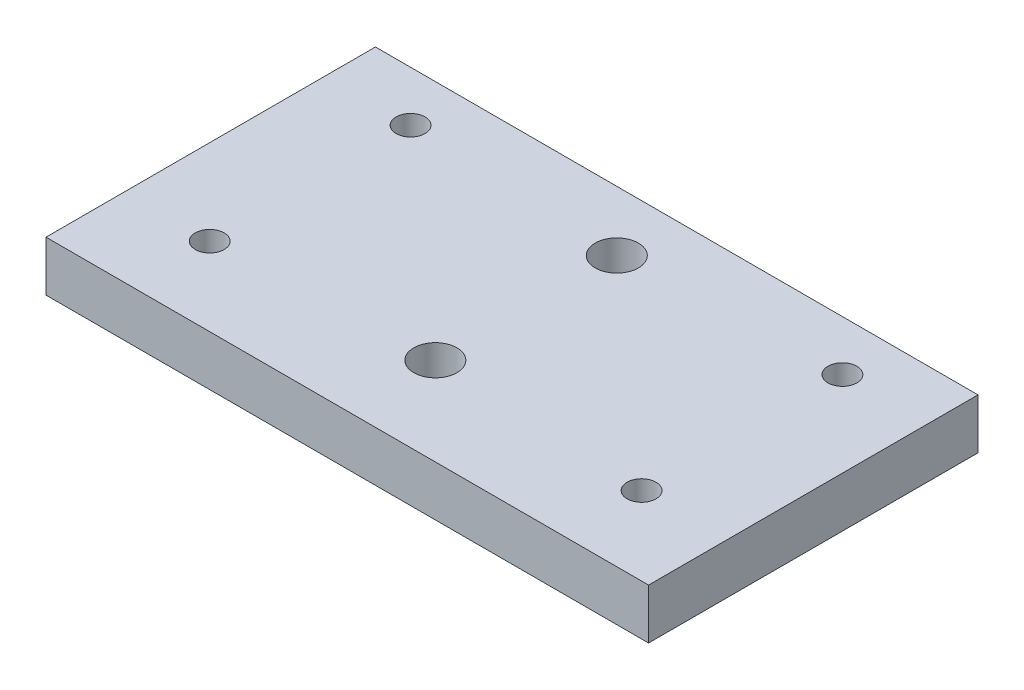
ISO-10303-21;
HEADER;
FILE_DESCRIPTION(('STEP AP214'),'2;1');
FILE_NAME('part.step','',(''),(''),'','','');
FILE_SCHEMA(('AUTOMOTIVE_DESIGN { 1 0 10303 214 1 1 1 1 }'));
ENDSEC;
DATA;
#1=APPLICATION_CONTEXT('core data for automotive mechanical design processes');
#2=APPLICATION_PROTOCOL_DEFINITION('international standard','automotive_design',2000,#1);
#3=PRODUCT_CONTEXT('',#1,'mechanical');
#4=PRODUCT('Part','Part','',(#3));
#5=PRODUCT_RELATED_PRODUCT_CATEGORY('part','',(#4));
#6=PRODUCT_DEFINITION_FORMATION('','',#4);
#7=PRODUCT_DEFINITION_CONTEXT('part definition',#1,'design');
#8=PRODUCT_DEFINITION('design','',#6,#7);
#9=PRODUCT_DEFINITION_SHAPE('','',#8);
#10=(LENGTH_UNIT() NAMED_UNIT(*) SI_UNIT(.MILLI.,.METRE.));
#11=(NAMED_UNIT(*) PLANE_ANGLE_UNIT() SI_UNIT($,.RADIAN.));
#12=(NAMED_UNIT(*) SI_UNIT($,.STERADIAN.) SOLID_ANGLE_UNIT());
#13=UNCERTAINTY_MEASURE_WITH_UNIT(LENGTH_MEASURE(1.E-05),#10,'distance_accuracy_value','');
#14=(GEOMETRIC_REPRESENTATION_CONTEXT(3) GLOBAL_UNCERTAINTY_ASSIGNED_CONTEXT((#13)) GLOBAL_UNIT_ASSIGNED_CONTEXT((#10,
#11,#12)) REPRESENTATION_CONTEXT('',''));
#15=CARTESIAN_POINT('',(0.,0.,0.));
#16=DIRECTION('',(0.,0.,1.));
#17=DIRECTION('',(1.,0.,0.));
#18=AXIS2_PLACEMENT_3D('',#15,#16,#17);
#19=CARTESIAN_POINT('',(38.1,-6.35,-76.2));
#20=DIRECTION('',(1.,0.,0.));
#21=DIRECTION('',(0.,0.,-1.));
#22=AXIS2_PLACEMENT_3D('',#19,#20,#21);
#23=PLANE('',#22);
#24=DIRECTION('',(0.,1.,0.));
#25=VECTOR('',#24,1.);
#26=CARTESIAN_POINT('',(38.1,-6.35,-34.5401915453713));
#27=LINE('',#26,#25);
#28=CARTESIAN_POINT('',(38.1,-6.35,-34.5401915453713));
#29=VERTEX_POINT('',#28);
#30=CARTESIAN_POINT('',(38.1,0.,-34.5401915453714));
#31=VERTEX_POINT('',#30);
#32=EDGE_CURVE('E47',#29,#31,#27,.T.);
#33=ORIENTED_EDGE('',*,*,#32,.F.);
#34=DIRECTION('',(0.,0.,-1.));
#35=VECTOR('',#34,1.);
#36=CARTESIAN_POINT('',(38.1,-6.35,-76.2));
#37=LINE('',#36,#35);
#38=CARTESIAN_POINT('',(38.1,-6.35,-76.2));
#39=VERTEX_POINT('',#38);
#40=EDGE_CURVE('E83',#29,#39,#37,.T.);
#41=ORIENTED_EDGE('',*,*,#40,.T.);
#42=DIRECTION('',(0.,1.,0.));
#43=VECTOR('',#42,1.);
#44=CARTESIAN_POINT('',(38.1,-6.35,-76.2));
#45=LINE('',#44,#43);
#46=CARTESIAN_POINT('',(38.1,0.,-76.2));
#47=VERTEX_POINT('',#46);
#48=EDGE_CURVE('E74',#39,#47,#45,.T.);
#49=ORIENTED_EDGE('',*,*,#48,.T.);
#50=DIRECTION('',(0.,0.,-1.));
#51=VECTOR('',#50,1.);
#52=CARTESIAN_POINT('',(38.1,0.,-76.2));
#53=LINE('',#52,#51);
#54=EDGE_CURVE('E88',#31,#47,#53,.T.);
#55=ORIENTED_EDGE('',*,*,#54,.F.);
#56=EDGE_LOOP('',(#33,#41,#49,#55));
#57=FACE_BOUND('',#56,.T.);
#58=ADVANCED_FACE('F34',(#57),#23,.T.);
#59=CARTESIAN_POINT('',(-38.1,-6.35,-76.2));
#60=DIRECTION('',(-1.,0.,0.));
#61=DIRECTION('',(0.,0.,1.));
#62=AXIS2_PLACEMENT_3D('',#59,#60,#61);
#63=PLANE('',#62);
#64=DIRECTION('',(0.,1.,0.));
#65=VECTOR('',#64,1.);
#66=CARTESIAN_POINT('',(-38.1,-6.35,-34.5401915453713));
#67=LINE('',#66,#65);
#68=CARTESIAN_POINT('',(-38.1,-6.35,-34.5401915453713));
#69=VERTEX_POINT('',#68);
#70=CARTESIAN_POINT('',(-38.1,0.,-34.5401915453713));
#71=VERTEX_POINT('',#70);
#72=EDGE_CURVE('E81',#69,#71,#67,.T.);
#73=ORIENTED_EDGE('',*,*,#72,.T.);
#74=DIRECTION('',(0.,0.,1.));
#75=VECTOR('',#74,1.);
#76=CARTESIAN_POINT('',(-38.1,0.,-76.2));
#77=LINE('',#76,#75);
#78=CARTESIAN_POINT('',(-38.1,0.,-76.2));
#79=VERTEX_POINT('',#78);
#80=EDGE_CURVE('E78',#79,#71,#77,.T.);
#81=ORIENTED_EDGE('',*,*,#80,.F.);
#82=DIRECTION('',(0.,1.,0.));
#83=VECTOR('',#82,1.);
#84=CARTESIAN_POINT('',(-38.1,-6.35,-76.2));
#85=LINE('',#84,#83);
#86=CARTESIAN_POINT('',(-38.1,-6.35,-76.2));
#87=VERTEX_POINT('',#86);
#88=EDGE_CURVE('E41',#87,#79,#85,.T.);
#89=ORIENTED_EDGE('',*,*,#88,.F.);
#90=DIRECTION('',(0.,0.,1.));
#91=VECTOR('',#90,1.);
#92=CARTESIAN_POINT('',(-38.1,-6.35,-76.2));
#93=LINE('',#92,#91);
#94=EDGE_CURVE('E94',#87,#69,#93,.T.);
#95=ORIENTED_EDGE('',*,*,#94,.T.);
#96=EDGE_LOOP('',(#73,#81,#89,#95));
#97=FACE_BOUND('',#96,.T.);
#98=ADVANCED_FACE('F79',(#97),#63,.T.);
#99=CARTESIAN_POINT('',(-38.1,-6.35,-76.2));
#100=DIRECTION('',(0.,0.,-1.));
#101=DIRECTION('',(-1.,0.,0.));
#102=AXIS2_PLACEMENT_3D('',#99,#100,#101);
#103=PLANE('',#102);
#104=DIRECTION('',(-1.,0.,0.));
#105=VECTOR('',#104,1.);
#106=CARTESIAN_POINT('',(-38.1,0.,-76.2));
#107=LINE('',#106,#105);
#108=EDGE_CURVE('E71',#47,#79,#107,.T.);
#109=ORIENTED_EDGE('',*,*,#108,.F.);
#110=ORIENTED_EDGE('',*,*,#48,.F.);
#111=DIRECTION('',(-1.,0.,0.));
#112=VECTOR('',#111,1.);
#113=CARTESIAN_POINT('',(-38.1,-6.35,-76.2));
#114=LINE('',#113,#112);
#115=EDGE_CURVE('E73',#39,#87,#114,.T.);
#116=ORIENTED_EDGE('',*,*,#115,.T.);
#117=ORIENTED_EDGE('',*,*,#88,.T.);
#118=EDGE_LOOP('',(#109,#110,#116,#117));
#119=FACE_BOUND('',#118,.T.);
#120=ADVANCED_FACE('F68',(#119),#103,.T.);
#121=CARTESIAN_POINT('',(0.,-6.35,0.));
#122=DIRECTION('',(0.,1.,0.));
#123=DIRECTION('',(0.,0.,1.));
#124=AXIS2_PLACEMENT_3D('',#121,#122,#123);
#125=PLANE('',#124);
#126=CARTESIAN_POINT('',(0.,-6.35,-68.6220095000234));
#127=DIRECTION('',(0.,1.,0.));
#128=DIRECTION('',(0.,0.,-1.));
#129=AXIS2_PLACEMENT_3D('',#126,#127,#128);
#130=CIRCLE('',#129,2.7305);
#131=CARTESIAN_POINT('',(0.,-6.35,-71.3525095000234));
#132=VERTEX_POINT('',#131);
#133=EDGE_CURVE('E127',#132,#132,#130,.T.);
#134=ORIENTED_EDGE('',*,*,#133,.T.);
#135=EDGE_LOOP('',(#134));
#136=FACE_BOUND('',#135,.T.);
#137=CARTESIAN_POINT('',(-27.305,-6.35,-69.85));
#138=DIRECTION('',(0.,1.,0.));
#139=DIRECTION('',(0.,0.,-1.));
#140=AXIS2_PLACEMENT_3D('',#137,#138,#139);
#141=CIRCLE('',#140,1.8288);
#142=CARTESIAN_POINT('',(-27.305,-6.35,-71.6788));
#143=VERTEX_POINT('',#142);
#144=EDGE_CURVE('E121',#143,#143,#141,.T.);
#145=ORIENTED_EDGE('',*,*,#144,.T.);
#146=EDGE_LOOP('',(#145));
#147=FACE_BOUND('',#146,.T.);
#148=CARTESIAN_POINT('',(27.305,-6.35,-69.85));
#149=DIRECTION('',(0.,1.,0.));
#150=DIRECTION('',(0.,0.,-1.));
#151=AXIS2_PLACEMENT_3D('',#148,#149,#150);
#152=CIRCLE('',#151,1.8288);
#153=CARTESIAN_POINT('',(27.305,-6.35,-71.6788));
#154=VERTEX_POINT('',#153);
#155=EDGE_CURVE('E115',#154,#154,#152,.T.);
#156=ORIENTED_EDGE('',*,*,#155,.T.);
#157=EDGE_LOOP('',(#156));
#158=FACE_BOUND('',#157,.T.);
#159=CARTESIAN_POINT('',(-27.305,-6.35,-44.45));
#160=DIRECTION('',(0.,1.,0.));
#161=DIRECTION('',(0.,0.,1.));
#162=AXIS2_PLACEMENT_3D('',#159,#160,#161);
#163=CIRCLE('',#162,1.8288);
#164=CARTESIAN_POINT('',(-27.305,-6.35,-42.6212));
#165=VERTEX_POINT('',#164);
#166=EDGE_CURVE('E109',#165,#165,#163,.T.);
#167=ORIENTED_EDGE('',*,*,#166,.T.);
#168=EDGE_LOOP('',(#167));
#169=FACE_BOUND('',#168,.T.);
#170=CARTESIAN_POINT('',(0.,-6.35,-45.6779904999767));
#171=DIRECTION('',(0.,1.,0.));
#172=DIRECTION('',(0.,0.,1.));
#173=AXIS2_PLACEMENT_3D('',#170,#171,#172);
#174=CIRCLE('',#173,2.7305);
#175=CARTESIAN_POINT('',(0.,-6.35,-42.9474904999767));
#176=VERTEX_POINT('',#175);
#177=EDGE_CURVE('E103',#176,#176,#174,.T.);
#178=ORIENTED_EDGE('',*,*,#177,.T.);
#179=EDGE_LOOP('',(#178));
#180=FACE_BOUND('',#179,.T.);
#181=CARTESIAN_POINT('',(27.305,-6.35,-44.45));
#182=DIRECTION('',(0.,1.,0.));
#183=DIRECTION('',(0.,0.,1.));
#184=AXIS2_PLACEMENT_3D('',#181,#182,#183);
#185=CIRCLE('',#184,1.8288);
#186=CARTESIAN_POINT('',(27.305,-6.35,-42.6212));
#187=VERTEX_POINT('',#186);
#188=EDGE_CURVE('E91',#187,#187,#185,.T.);
#189=ORIENTED_EDGE('',*,*,#188,.T.);
#190=EDGE_LOOP('',(#189));
#191=FACE_BOUND('',#190,.T.);
#192=ORIENTED_EDGE('',*,*,#40,.F.);
#193=DIRECTION('',(-1.,0.,0.));
#194=VECTOR('',#193,1.);
#195=CARTESIAN_POINT('',(38.1,-6.35,-34.5401915453713));
#196=LINE('',#195,#194);
#197=EDGE_CURVE('E136',#29,#69,#196,.T.);
#198=ORIENTED_EDGE('',*,*,#197,.T.);
#199=ORIENTED_EDGE('',*,*,#94,.F.);
#200=ORIENTED_EDGE('',*,*,#115,.F.);
#201=EDGE_LOOP('',(#192,#198,#199,#200));
#202=FACE_BOUND('',#201,.T.);
#203=ADVANCED_FACE('F141',(#136,#147,#158,#169,#180,#191,#202),#125,.F.);
#204=CARTESIAN_POINT('',(0.,0.,0.));
#205=DIRECTION('',(0.,1.,0.));
#206=DIRECTION('',(0.,0.,1.));
#207=AXIS2_PLACEMENT_3D('',#204,#205,#206);
#208=PLANE('',#207);
#209=DIRECTION('',(-1.,0.,0.));
#210=VECTOR('',#209,1.);
#211=CARTESIAN_POINT('',(0.,0.,-34.5401915453713));
#212=LINE('',#211,#210);
#213=EDGE_CURVE('E11',#31,#71,#212,.T.);
#214=ORIENTED_EDGE('',*,*,#213,.F.);
#215=ORIENTED_EDGE('',*,*,#54,.T.);
#216=ORIENTED_EDGE('',*,*,#108,.T.);
#217=ORIENTED_EDGE('',*,*,#80,.T.);
#218=EDGE_LOOP('',(#214,#215,#216,#217));
#219=FACE_BOUND('',#218,.T.);
#220=CARTESIAN_POINT('',(0.,0.,-68.6220095000234));
#221=DIRECTION('',(0.,1.,0.));
#222=DIRECTION('',(0.,0.,-1.));
#223=AXIS2_PLACEMENT_3D('',#220,#221,#222);
#224=CIRCLE('',#223,2.7305);
#225=CARTESIAN_POINT('',(0.,0.,-71.3525095000234));
#226=VERTEX_POINT('',#225);
#227=EDGE_CURVE('E130',#226,#226,#224,.T.);
#228=ORIENTED_EDGE('',*,*,#227,.F.);
#229=EDGE_LOOP('',(#228));
#230=FACE_BOUND('',#229,.T.);
#231=CARTESIAN_POINT('',(-27.305,0.,-69.85));
#232=DIRECTION('',(0.,1.,0.));
#233=DIRECTION('',(0.,0.,-1.));
#234=AXIS2_PLACEMENT_3D('',#231,#232,#233);
#235=CIRCLE('',#234,1.8288);
#236=CARTESIAN_POINT('',(-27.305,0.,-71.6788));
#237=VERTEX_POINT('',#236);
#238=EDGE_CURVE('E124',#237,#237,#235,.T.);
#239=ORIENTED_EDGE('',*,*,#238,.F.);
#240=EDGE_LOOP('',(#239));
#241=FACE_BOUND('',#240,.T.);
#242=CARTESIAN_POINT('',(27.305,0.,-69.85));
#243=DIRECTION('',(0.,1.,0.));
#244=DIRECTION('',(0.,0.,-1.));
#245=AXIS2_PLACEMENT_3D('',#242,#243,#244);
#246=CIRCLE('',#245,1.8288);
#247=CARTESIAN_POINT('',(27.305,0.,-71.6788));
#248=VERTEX_POINT('',#247);
#249=EDGE_CURVE('E118',#248,#248,#246,.T.);
#250=ORIENTED_EDGE('',*,*,#249,.F.);
#251=EDGE_LOOP('',(#250));
#252=FACE_BOUND('',#251,.T.);
#253=CARTESIAN_POINT('',(-27.305,0.,-44.45));
#254=DIRECTION('',(0.,1.,0.));
#255=DIRECTION('',(0.,0.,1.));
#256=AXIS2_PLACEMENT_3D('',#253,#254,#255);
#257=CIRCLE('',#256,1.8288);
#258=CARTESIAN_POINT('',(-27.305,0.,-42.6212));
#259=VERTEX_POINT('',#258);
#260=EDGE_CURVE('E112',#259,#259,#257,.T.);
#261=ORIENTED_EDGE('',*,*,#260,.F.);
#262=EDGE_LOOP('',(#261));
#263=FACE_BOUND('',#262,.T.);
#264=CARTESIAN_POINT('',(0.,0.,-45.6779904999767));
#265=DIRECTION('',(0.,1.,0.));
#266=DIRECTION('',(0.,0.,1.));
#267=AXIS2_PLACEMENT_3D('',#264,#265,#266);
#268=CIRCLE('',#267,2.7305);
#269=CARTESIAN_POINT('',(0.,0.,-42.9474904999767));
#270=VERTEX_POINT('',#269);
#271=EDGE_CURVE('E106',#270,#270,#268,.T.);
#272=ORIENTED_EDGE('',*,*,#271,.F.);
#273=EDGE_LOOP('',(#272));
#274=FACE_BOUND('',#273,.T.);
#275=CARTESIAN_POINT('',(27.305,0.,-44.45));
#276=DIRECTION('',(0.,1.,0.));
#277=DIRECTION('',(0.,0.,1.));
#278=AXIS2_PLACEMENT_3D('',#275,#276,#277);
#279=CIRCLE('',#278,1.8288);
#280=CARTESIAN_POINT('',(27.305,0.,-42.6212));
#281=VERTEX_POINT('',#280);
#282=EDGE_CURVE('E100',#281,#281,#279,.T.);
#283=ORIENTED_EDGE('',*,*,#282,.F.);
#284=EDGE_LOOP('',(#283));
#285=FACE_BOUND('',#284,.T.);
#286=ADVANCED_FACE('F85',(#219,#230,#241,#252,#263,#274,#285),#208,.T.);
#287=CARTESIAN_POINT('',(27.305,-6.35,-44.45));
#288=DIRECTION('',(0.,1.,0.));
#289=DIRECTION('',(0.,0.,1.));
#290=AXIS2_PLACEMENT_3D('',#287,#288,#289);
#291=CYLINDRICAL_SURFACE('',#290,1.8288);
#292=ORIENTED_EDGE('',*,*,#188,.F.);
#293=EDGE_LOOP('',(#292));
#294=FACE_BOUND('',#293,.T.);
#295=ORIENTED_EDGE('',*,*,#282,.T.);
#296=EDGE_LOOP('',(#295));
#297=FACE_BOUND('',#296,.T.);
#298=ADVANCED_FACE('F157',(#294,#297),#291,.F.);
#299=CARTESIAN_POINT('',(0.,-6.35,-45.6779904999767));
#300=DIRECTION('',(0.,1.,0.));
#301=DIRECTION('',(0.,0.,1.));
#302=AXIS2_PLACEMENT_3D('',#299,#300,#301);
#303=CYLINDRICAL_SURFACE('',#302,2.7305);
#304=ORIENTED_EDGE('',*,*,#177,.F.);
#305=EDGE_LOOP('',(#304));
#306=FACE_BOUND('',#305,.T.);
#307=ORIENTED_EDGE('',*,*,#271,.T.);
#308=EDGE_LOOP('',(#307));
#309=FACE_BOUND('',#308,.T.);
#310=ADVANCED_FACE('F163',(#306,#309),#303,.F.);
#311=CARTESIAN_POINT('',(-27.305,-6.35,-44.45));
#312=DIRECTION('',(0.,1.,0.));
#313=DIRECTION('',(0.,0.,1.));
#314=AXIS2_PLACEMENT_3D('',#311,#312,#313);
#315=CYLINDRICAL_SURFACE('',#314,1.8288);
#316=ORIENTED_EDGE('',*,*,#166,.F.);
#317=EDGE_LOOP('',(#316));
#318=FACE_BOUND('',#317,.T.);
#319=ORIENTED_EDGE('',*,*,#260,.T.);
#320=EDGE_LOOP('',(#319));
#321=FACE_BOUND('',#320,.T.);
#322=ADVANCED_FACE('F167',(#318,#321),#315,.F.);
#323=CARTESIAN_POINT('',(27.305,-6.35,-69.85));
#324=DIRECTION('',(0.,1.,0.));
#325=DIRECTION('',(0.,0.,1.));
#326=AXIS2_PLACEMENT_3D('',#323,#324,#325);
#327=CYLINDRICAL_SURFACE('',#326,1.8288);
#328=ORIENTED_EDGE('',*,*,#155,.F.);
#329=EDGE_LOOP('',(#328));
#330=FACE_BOUND('',#329,.T.);
#331=ORIENTED_EDGE('',*,*,#249,.T.);
#332=EDGE_LOOP('',(#331));
#333=FACE_BOUND('',#332,.T.);
#334=ADVANCED_FACE('F171',(#330,#333),#327,.F.);
#335=CARTESIAN_POINT('',(-27.305,-6.35,-69.85));
#336=DIRECTION('',(0.,1.,0.));
#337=DIRECTION('',(0.,0.,1.));
#338=AXIS2_PLACEMENT_3D('',#335,#336,#337);
#339=CYLINDRICAL_SURFACE('',#338,1.8288);
#340=ORIENTED_EDGE('',*,*,#144,.F.);
#341=EDGE_LOOP('',(#340));
#342=FACE_BOUND('',#341,.T.);
#343=ORIENTED_EDGE('',*,*,#238,.T.);
#344=EDGE_LOOP('',(#343));
#345=FACE_BOUND('',#344,.T.);
#346=ADVANCED_FACE('F175',(#342,#345),#339,.F.);
#347=CARTESIAN_POINT('',(0.,-6.35,-68.6220095000234));
#348=DIRECTION('',(0.,1.,0.));
#349=DIRECTION('',(0.,0.,1.));
#350=AXIS2_PLACEMENT_3D('',#347,#348,#349);
#351=CYLINDRICAL_SURFACE('',#350,2.7305);
#352=ORIENTED_EDGE('',*,*,#133,.F.);
#353=EDGE_LOOP('',(#352));
#354=FACE_BOUND('',#353,.T.);
#355=ORIENTED_EDGE('',*,*,#227,.T.);
#356=EDGE_LOOP('',(#355));
#357=FACE_BOUND('',#356,.T.);
#358=ADVANCED_FACE('F179',(#354,#357),#351,.F.);
#359=CARTESIAN_POINT('',(38.1,-6.35,-34.5401915453713));
#360=DIRECTION('',(0.,0.,-1.));
#361=DIRECTION('',(-1.,0.,0.));
#362=AXIS2_PLACEMENT_3D('',#359,#360,#361);
#363=PLANE('',#362);
#364=ORIENTED_EDGE('',*,*,#213,.T.);
#365=ORIENTED_EDGE('',*,*,#72,.F.);
#366=ORIENTED_EDGE('',*,*,#197,.F.);
#367=ORIENTED_EDGE('',*,*,#32,.T.);
#368=EDGE_LOOP('',(#364,#365,#366,#367));
#369=FACE_BOUND('',#368,.T.);
#370=ADVANCED_FACE('F144',(#369),#363,.F.);
#371=CLOSED_SHELL('',(#58,#98,#120,#203,#286,#298,#310,#322,#334,#346,#358,#370));
#372=MANIFOLD_SOLID_BREP('B2',#371);
#373=ADVANCED_BREP_SHAPE_REPRESENTATION('',(#18,#372),#14);
#374=SHAPE_DEFINITION_REPRESENTATION(#9,#373);
ENDSEC;
END-ISO-10303-21;
